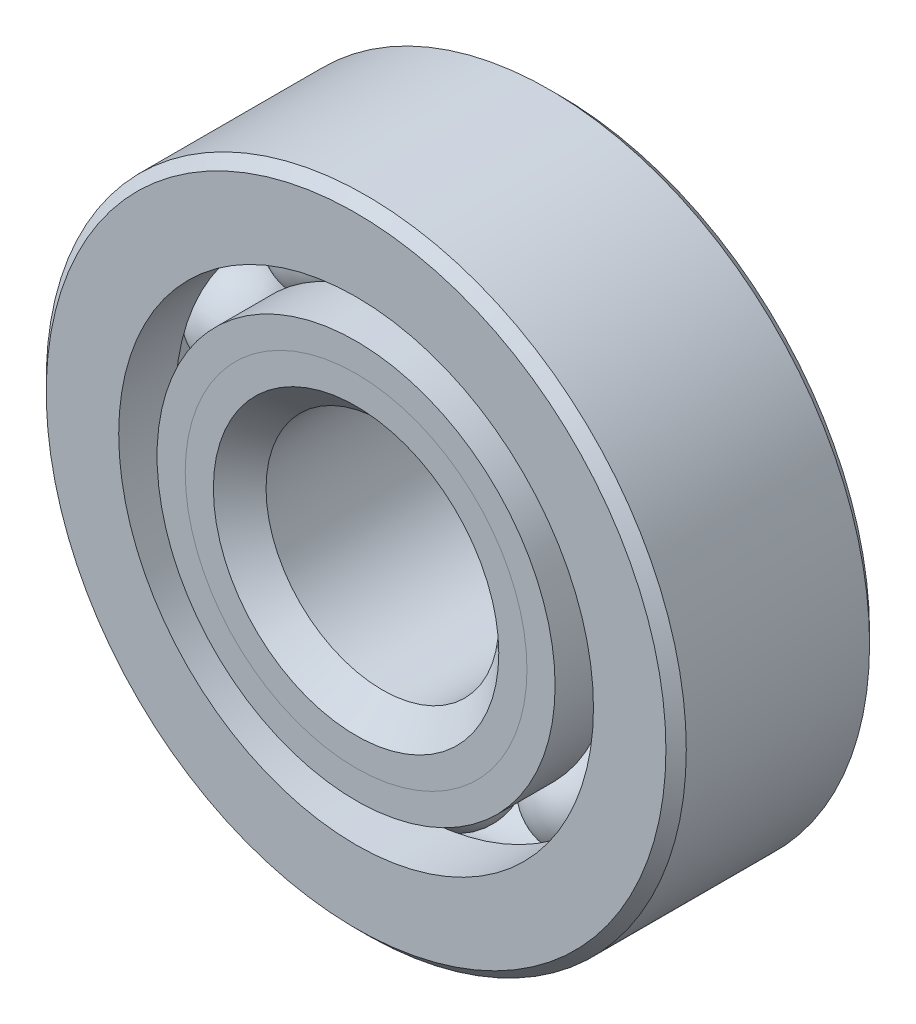
ISO-10303-21;
HEADER;
FILE_DESCRIPTION(('STEP AP214'),'2;1');
FILE_NAME('part.step','',(''),(''),'','','');
FILE_SCHEMA(('AUTOMOTIVE_DESIGN { 1 0 10303 214 1 1 1 1 }'));
ENDSEC;
DATA;
#1=APPLICATION_CONTEXT('core data for automotive mechanical design processes');
#2=APPLICATION_PROTOCOL_DEFINITION('international standard','automotive_design',2000,#1);
#3=PRODUCT_CONTEXT('',#1,'mechanical');
#4=PRODUCT('Part','Part','',(#3));
#5=PRODUCT_RELATED_PRODUCT_CATEGORY('part','',(#4));
#6=PRODUCT_DEFINITION_FORMATION('','',#4);
#7=PRODUCT_DEFINITION_CONTEXT('part definition',#1,'design');
#8=PRODUCT_DEFINITION('design','',#6,#7);
#9=PRODUCT_DEFINITION_SHAPE('','',#8);
#10=(LENGTH_UNIT() NAMED_UNIT(*) SI_UNIT(.MILLI.,.METRE.));
#11=(NAMED_UNIT(*) PLANE_ANGLE_UNIT() SI_UNIT($,.RADIAN.));
#12=(NAMED_UNIT(*) SI_UNIT($,.STERADIAN.) SOLID_ANGLE_UNIT());
#13=UNCERTAINTY_MEASURE_WITH_UNIT(LENGTH_MEASURE(1.E-05),#10,'distance_accuracy_value','');
#14=(GEOMETRIC_REPRESENTATION_CONTEXT(3) GLOBAL_UNCERTAINTY_ASSIGNED_CONTEXT((#13)) GLOBAL_UNIT_ASSIGNED_CONTEXT((#10,
#11,#12)) REPRESENTATION_CONTEXT('',''));
#15=CARTESIAN_POINT('',(0.,0.,0.));
#16=DIRECTION('',(0.,0.,1.));
#17=DIRECTION('',(1.,0.,0.));
#18=AXIS2_PLACEMENT_3D('',#15,#16,#17);
#19=CARTESIAN_POINT('',(-4.40838939219347,6.06762745781216,0.));
#20=DIRECTION('',(0.,0.,1.));
#21=DIRECTION('',(-0.587785252292462,0.809016994374955,0.));
#22=AXIS2_PLACEMENT_3D('',#19,#20,#21);
#23=SPHERICAL_SURFACE('',#22,1.68952158656808);
#24=CARTESIAN_POINT('',(-4.40838939219347,6.06762745781216,1.68952158656808));
#25=VERTEX_POINT('',#24);
#26=VERTEX_LOOP('',#25);
#27=FACE_BOUND('',#26,.T.);
#28=ADVANCED_FACE('F39',(#27),#23,.T.);
#29=CLOSED_SHELL('',(#28));
#30=MANIFOLD_SOLID_BREP('B2',#29);
#31=CARTESIAN_POINT('',(-7.13292387221363,2.31762745781219,0.));
#32=DIRECTION('',(0.,0.,1.));
#33=DIRECTION('',(-0.95105651629515,0.309016994374958,0.));
#34=AXIS2_PLACEMENT_3D('',#31,#32,#33);
#35=SPHERICAL_SURFACE('',#34,1.68952158656808);
#36=CARTESIAN_POINT('',(-7.13292387221363,2.31762745781219,1.68952158656808));
#37=VERTEX_POINT('',#36);
#38=VERTEX_LOOP('',#37);
#39=FACE_BOUND('',#38,.T.);
#40=ADVANCED_FACE('F70',(#39),#35,.T.);
#41=CLOSED_SHELL('',(#40));
#42=MANIFOLD_SOLID_BREP('B6',#41);
#43=CARTESIAN_POINT('',(-7.13292387221367,-2.31762745781204,0.));
#44=DIRECTION('',(0.,0.,1.));
#45=DIRECTION('',(-0.951056516295157,-0.309016994374938,0.));
#46=AXIS2_PLACEMENT_3D('',#43,#44,#45);
#47=SPHERICAL_SURFACE('',#46,1.68952158656808);
#48=CARTESIAN_POINT('',(-7.13292387221367,-2.31762745781204,1.68952158656808));
#49=VERTEX_POINT('',#48);
#50=VERTEX_LOOP('',#49);
#51=FACE_BOUND('',#50,.T.);
#52=ADVANCED_FACE('F101',(#51),#47,.T.);
#53=CLOSED_SHELL('',(#52));
#54=MANIFOLD_SOLID_BREP('B35',#53);
#55=CARTESIAN_POINT('',(-4.4083893921936,-6.06762745781207,0.));
#56=DIRECTION('',(0.,0.,1.));
#57=DIRECTION('',(-0.58778525229248,-0.809016994374942,0.));
#58=AXIS2_PLACEMENT_3D('',#55,#56,#57);
#59=SPHERICAL_SURFACE('',#58,1.68952158656808);
#60=CARTESIAN_POINT('',(-4.4083893921936,-6.06762745781207,1.68952158656808));
#61=VERTEX_POINT('',#60);
#62=VERTEX_LOOP('',#61);
#63=FACE_BOUND('',#62,.T.);
#64=ADVANCED_FACE('F132',(#63),#59,.T.);
#65=CLOSED_SHELL('',(#64));
#66=MANIFOLD_SOLID_BREP('B66',#65);
#67=CARTESIAN_POINT('',(0.,-7.5,0.));
#68=DIRECTION('',(0.,0.,1.));
#69=DIRECTION('',(0.,-1.,0.));
#70=AXIS2_PLACEMENT_3D('',#67,#68,#69);
#71=SPHERICAL_SURFACE('',#70,1.68952158656808);
#72=CARTESIAN_POINT('',(0.,-7.5,1.68952158656808));
#73=VERTEX_POINT('',#72);
#74=VERTEX_LOOP('',#73);
#75=FACE_BOUND('',#74,.T.);
#76=ADVANCED_FACE('F165',(#75),#71,.T.);
#77=CLOSED_SHELL('',(#76));
#78=MANIFOLD_SOLID_BREP('B97',#77);
#79=CARTESIAN_POINT('',(4.40838939219351,-6.06762745781213,0.));
#80=DIRECTION('',(0.,0.,1.));
#81=DIRECTION('',(0.587785252292469,-0.809016994374951,0.));
#82=AXIS2_PLACEMENT_3D('',#79,#80,#81);
#83=SPHERICAL_SURFACE('',#82,1.68952158656808);
#84=CARTESIAN_POINT('',(4.40838939219351,-6.06762745781213,1.68952158656808));
#85=VERTEX_POINT('',#84);
#86=VERTEX_LOOP('',#85);
#87=FACE_BOUND('',#86,.T.);
#88=ADVANCED_FACE('F196',(#87),#83,.T.);
#89=CLOSED_SHELL('',(#88));
#90=MANIFOLD_SOLID_BREP('B128',#89);
#91=CARTESIAN_POINT('',(7.13292387221364,-2.31762745781214,0.));
#92=DIRECTION('',(0.,0.,1.));
#93=DIRECTION('',(0.951056516295152,-0.309016994374952,0.));
#94=AXIS2_PLACEMENT_3D('',#91,#92,#93);
#95=SPHERICAL_SURFACE('',#94,1.68952158656808);
#96=CARTESIAN_POINT('',(7.13292387221364,-2.31762745781214,1.68952158656808));
#97=VERTEX_POINT('',#96);
#98=VERTEX_LOOP('',#97);
#99=FACE_BOUND('',#98,.T.);
#100=ADVANCED_FACE('F227',(#99),#95,.T.);
#101=CLOSED_SHELL('',(#100));
#102=MANIFOLD_SOLID_BREP('B161',#101);
#103=CARTESIAN_POINT('',(7.13292387221366,2.31762745781209,0.));
#104=DIRECTION('',(0.,0.,1.));
#105=DIRECTION('',(0.951056516295155,0.309016994374945,0.));
#106=AXIS2_PLACEMENT_3D('',#103,#104,#105);
#107=SPHERICAL_SURFACE('',#106,1.68952158656808);
#108=CARTESIAN_POINT('',(7.13292387221366,2.31762745781209,1.68952158656808));
#109=VERTEX_POINT('',#108);
#110=VERTEX_LOOP('',#109);
#111=FACE_BOUND('',#110,.T.);
#112=ADVANCED_FACE('F258',(#111),#107,.T.);
#113=CLOSED_SHELL('',(#112));
#114=MANIFOLD_SOLID_BREP('B192',#113);
#115=CARTESIAN_POINT('',(4.40838939219356,6.0676274578121,0.));
#116=DIRECTION('',(0.,0.,1.));
#117=DIRECTION('',(0.587785252292474,0.809016994374947,0.));
#118=AXIS2_PLACEMENT_3D('',#115,#116,#117);
#119=SPHERICAL_SURFACE('',#118,1.68952158656808);
#120=CARTESIAN_POINT('',(4.40838939219356,6.0676274578121,1.68952158656808));
#121=VERTEX_POINT('',#120);
#122=VERTEX_LOOP('',#121);
#123=FACE_BOUND('',#122,.T.);
#124=ADVANCED_FACE('F289',(#123),#119,.T.);
#125=CLOSED_SHELL('',(#124));
#126=MANIFOLD_SOLID_BREP('B223',#125);
#127=CARTESIAN_POINT('',(0.,7.5,0.));
#128=DIRECTION('',(0.,0.,1.));
#129=DIRECTION('',(0.,1.,0.));
#130=AXIS2_PLACEMENT_3D('',#127,#128,#129);
#131=SPHERICAL_SURFACE('',#130,1.68952158656808);
#132=CARTESIAN_POINT('',(0.,7.5,1.68952158656808));
#133=VERTEX_POINT('',#132);
#134=VERTEX_LOOP('',#133);
#135=FACE_BOUND('',#134,.T.);
#136=ADVANCED_FACE('F324',(#135),#131,.T.);
#137=CLOSED_SHELL('',(#136));
#138=MANIFOLD_SOLID_BREP('B254',#137);
#139=CARTESIAN_POINT('',(0.,5.87294927368765,3.5));
#140=DIRECTION('',(0.,0.,-1.));
#141=DIRECTION('',(-1.,0.,0.));
#142=AXIS2_PLACEMENT_3D('',#139,#140,#141);
#143=PLANE('',#142);
#144=CARTESIAN_POINT('',(0.,0.,3.5));
#145=DIRECTION('',(0.,0.,1.));
#146=DIRECTION('',(1.,0.,0.));
#147=AXIS2_PLACEMENT_3D('',#144,#145,#146);
#148=CIRCLE('',#147,4.90523920671596);
#149=CARTESIAN_POINT('',(4.90523920671596,0.,3.5));
#150=VERTEX_POINT('',#149);
#151=EDGE_CURVE('E378',#150,#150,#148,.T.);
#152=ORIENTED_EDGE('',*,*,#151,.F.);
#153=EDGE_LOOP('',(#152));
#154=FACE_BOUND('',#153,.T.);
#155=CARTESIAN_POINT('',(0.,0.,3.5));
#156=DIRECTION('',(0.,0.,1.));
#157=DIRECTION('',(1.,0.,0.));
#158=AXIS2_PLACEMENT_3D('',#155,#156,#157);
#159=CIRCLE('',#158,5.87294927368765);
#160=CARTESIAN_POINT('',(5.87294927368765,0.,3.5));
#161=VERTEX_POINT('',#160);
#162=EDGE_CURVE('E323',#161,#161,#159,.T.);
#163=ORIENTED_EDGE('',*,*,#162,.T.);
#164=EDGE_LOOP('',(#163));
#165=FACE_BOUND('',#164,.T.);
#166=ADVANCED_FACE('F344',(#154,#165),#143,.F.);
#167=CARTESIAN_POINT('',(0.,0.,2.53228993302831));
#168=DIRECTION('',(0.,0.,1.));
#169=DIRECTION('',(1.,0.,0.));
#170=AXIS2_PLACEMENT_3D('',#167,#168,#169);
#171=CONICAL_SURFACE('',#170,4.90523920671596,0.78539816339745);
#172=ORIENTED_EDGE('',*,*,#162,.F.);
#173=EDGE_LOOP('',(#172));
#174=FACE_BOUND('',#173,.T.);
#175=CARTESIAN_POINT('',(0.,0.,2.53228993302831));
#176=DIRECTION('',(0.,0.,1.));
#177=DIRECTION('',(1.,0.,0.));
#178=AXIS2_PLACEMENT_3D('',#175,#176,#177);
#179=CIRCLE('',#178,4.90523920671596);
#180=CARTESIAN_POINT('',(4.90523920671596,0.,2.53228993302831));
#181=VERTEX_POINT('',#180);
#182=EDGE_CURVE('E350',#181,#181,#179,.T.);
#183=ORIENTED_EDGE('',*,*,#182,.T.);
#184=EDGE_LOOP('',(#183));
#185=FACE_BOUND('',#184,.T.);
#186=ADVANCED_FACE('F385',(#174,#185),#171,.T.);
#187=CARTESIAN_POINT('',(0.,0.,3.5));
#188=DIRECTION('',(0.,0.,1.));
#189=DIRECTION('',(1.,0.,0.));
#190=AXIS2_PLACEMENT_3D('',#187,#188,#189);
#191=CYLINDRICAL_SURFACE('',#190,4.90523920671596);
#192=ORIENTED_EDGE('',*,*,#182,.F.);
#193=EDGE_LOOP('',(#192));
#194=FACE_BOUND('',#193,.T.);
#195=CARTESIAN_POINT('',(0.,0.,0.));
#196=DIRECTION('',(0.,0.,1.));
#197=DIRECTION('',(1.,0.,0.));
#198=AXIS2_PLACEMENT_3D('',#195,#196,#197);
#199=CIRCLE('',#198,4.90523920671596);
#200=CARTESIAN_POINT('',(4.90523920671596,0.,0.));
#201=VERTEX_POINT('',#200);
#202=EDGE_CURVE('E354',#201,#201,#199,.T.);
#203=ORIENTED_EDGE('',*,*,#202,.T.);
#204=EDGE_LOOP('',(#203));
#205=FACE_BOUND('',#204,.T.);
#206=ADVANCED_FACE('F389',(#194,#205),#191,.T.);
#207=CARTESIAN_POINT('',(0.,4.90523920671596,0.));
#208=DIRECTION('',(0.,0.,-1.));
#209=DIRECTION('',(-1.,0.,0.));
#210=AXIS2_PLACEMENT_3D('',#207,#208,#209);
#211=PLANE('',#210);
#212=ORIENTED_EDGE('',*,*,#202,.F.);
#213=EDGE_LOOP('',(#212));
#214=FACE_BOUND('',#213,.T.);
#215=CARTESIAN_POINT('',(0.,0.,0.));
#216=DIRECTION('',(0.,0.,1.));
#217=DIRECTION('',(1.,0.,0.));
#218=AXIS2_PLACEMENT_3D('',#215,#216,#217);
#219=CIRCLE('',#218,5.81047841343192);
#220=CARTESIAN_POINT('',(5.81047841343192,0.,0.));
#221=VERTEX_POINT('',#220);
#222=EDGE_CURVE('E358',#221,#221,#219,.T.);
#223=ORIENTED_EDGE('',*,*,#222,.T.);
#224=EDGE_LOOP('',(#223));
#225=FACE_BOUND('',#224,.T.);
#226=ADVANCED_FACE('F394',(#214,#225),#211,.F.);
#227=CARTESIAN_POINT('',(0.,0.,0.));
#228=DIRECTION('',(0.,0.,1.));
#229=DIRECTION('',(1.,0.,0.));
#230=AXIS2_PLACEMENT_3D('',#227,#228,#229);
#231=TOROIDAL_SURFACE('',#230,7.5,1.68952158656808);
#232=ORIENTED_EDGE('',*,*,#222,.F.);
#233=EDGE_LOOP('',(#232));
#234=FACE_BOUND('',#233,.T.);
#235=CARTESIAN_POINT('',(0.,0.,-1.55555555555556));
#236=DIRECTION('',(0.,0.,1.));
#237=DIRECTION('',(1.,0.,0.));
#238=AXIS2_PLACEMENT_3D('',#235,#236,#237);
#239=CIRCLE('',#238,6.84065934065934);
#240=CARTESIAN_POINT('',(6.84065934065934,0.,-1.55555555555556));
#241=VERTEX_POINT('',#240);
#242=EDGE_CURVE('E363',#241,#241,#239,.T.);
#243=ORIENTED_EDGE('',*,*,#242,.T.);
#244=EDGE_LOOP('',(#243));
#245=FACE_BOUND('',#244,.T.);
#246=ADVANCED_FACE('F400',(#234,#245),#231,.F.);
#247=CARTESIAN_POINT('',(0.,0.,3.5));
#248=DIRECTION('',(0.,0.,1.));
#249=DIRECTION('',(1.,0.,0.));
#250=AXIS2_PLACEMENT_3D('',#247,#248,#249);
#251=CYLINDRICAL_SURFACE('',#250,6.84065934065934);
#252=ORIENTED_EDGE('',*,*,#242,.F.);
#253=EDGE_LOOP('',(#252));
#254=FACE_BOUND('',#253,.T.);
#255=CARTESIAN_POINT('',(0.,0.,-3.5));
#256=DIRECTION('',(0.,0.,1.));
#257=DIRECTION('',(1.,0.,0.));
#258=AXIS2_PLACEMENT_3D('',#255,#256,#257);
#259=CIRCLE('',#258,6.84065934065934);
#260=CARTESIAN_POINT('',(6.84065934065934,0.,-3.5));
#261=VERTEX_POINT('',#260);
#262=EDGE_CURVE('E366',#261,#261,#259,.T.);
#263=ORIENTED_EDGE('',*,*,#262,.T.);
#264=EDGE_LOOP('',(#263));
#265=FACE_BOUND('',#264,.T.);
#266=ADVANCED_FACE('F404',(#254,#265),#251,.T.);
#267=CARTESIAN_POINT('',(0.,4.35,-3.5));
#268=DIRECTION('',(0.,0.,1.));
#269=DIRECTION('',(1.,0.,0.));
#270=AXIS2_PLACEMENT_3D('',#267,#268,#269);
#271=PLANE('',#270);
#272=ORIENTED_EDGE('',*,*,#262,.F.);
#273=EDGE_LOOP('',(#272));
#274=FACE_BOUND('',#273,.T.);
#275=CARTESIAN_POINT('',(0.,0.,-3.5));
#276=DIRECTION('',(0.,0.,1.));
#277=DIRECTION('',(1.,0.,0.));
#278=AXIS2_PLACEMENT_3D('',#275,#276,#277);
#279=CIRCLE('',#278,4.35);
#280=CARTESIAN_POINT('',(4.35,0.,-3.5));
#281=VERTEX_POINT('',#280);
#282=EDGE_CURVE('E369',#281,#281,#279,.T.);
#283=ORIENTED_EDGE('',*,*,#282,.T.);
#284=EDGE_LOOP('',(#283));
#285=FACE_BOUND('',#284,.T.);
#286=ADVANCED_FACE('F408',(#274,#285),#271,.F.);
#287=CARTESIAN_POINT('',(0.,0.,-3.15));
#288=DIRECTION('',(0.,0.,-1.));
#289=DIRECTION('',(-1.,0.,0.));
#290=AXIS2_PLACEMENT_3D('',#287,#288,#289);
#291=CONICAL_SURFACE('',#290,4.,0.785398163397448);
#292=ORIENTED_EDGE('',*,*,#282,.F.);
#293=EDGE_LOOP('',(#292));
#294=FACE_BOUND('',#293,.T.);
#295=CARTESIAN_POINT('',(0.,0.,-3.15));
#296=DIRECTION('',(0.,0.,1.));
#297=DIRECTION('',(1.,0.,0.));
#298=AXIS2_PLACEMENT_3D('',#295,#296,#297);
#299=CIRCLE('',#298,4.);
#300=CARTESIAN_POINT('',(4.,0.,-3.15));
#301=VERTEX_POINT('',#300);
#302=EDGE_CURVE('E372',#301,#301,#299,.T.);
#303=ORIENTED_EDGE('',*,*,#302,.T.);
#304=EDGE_LOOP('',(#303));
#305=FACE_BOUND('',#304,.T.);
#306=ADVANCED_FACE('F412',(#294,#305),#291,.F.);
#307=CARTESIAN_POINT('',(0.,0.,3.5));
#308=DIRECTION('',(0.,0.,1.));
#309=DIRECTION('',(1.,0.,0.));
#310=AXIS2_PLACEMENT_3D('',#307,#308,#309);
#311=CYLINDRICAL_SURFACE('',#310,4.);
#312=ORIENTED_EDGE('',*,*,#302,.F.);
#313=EDGE_LOOP('',(#312));
#314=FACE_BOUND('',#313,.T.);
#315=CARTESIAN_POINT('',(0.,0.,2.59476079328405));
#316=DIRECTION('',(0.,0.,1.));
#317=DIRECTION('',(1.,0.,0.));
#318=AXIS2_PLACEMENT_3D('',#315,#316,#317);
#319=CIRCLE('',#318,4.);
#320=CARTESIAN_POINT('',(4.,0.,2.59476079328405));
#321=VERTEX_POINT('',#320);
#322=EDGE_CURVE('E375',#321,#321,#319,.T.);
#323=ORIENTED_EDGE('',*,*,#322,.T.);
#324=EDGE_LOOP('',(#323));
#325=FACE_BOUND('',#324,.T.);
#326=ADVANCED_FACE('F416',(#314,#325),#311,.F.);
#327=CARTESIAN_POINT('',(0.,0.,3.5));
#328=DIRECTION('',(0.,0.,1.));
#329=DIRECTION('',(1.,0.,0.));
#330=AXIS2_PLACEMENT_3D('',#327,#328,#329);
#331=CONICAL_SURFACE('',#330,4.90523920671596,0.78539816339745);
#332=ORIENTED_EDGE('',*,*,#322,.F.);
#333=EDGE_LOOP('',(#332));
#334=FACE_BOUND('',#333,.T.);
#335=ORIENTED_EDGE('',*,*,#151,.T.);
#336=EDGE_LOOP('',(#335));
#337=FACE_BOUND('',#336,.T.);
#338=ADVANCED_FACE('F382',(#334,#337),#331,.F.);
#339=CLOSED_SHELL('',(#166,#186,#206,#226,#246,#266,#286,#306,#326,#338));
#340=MANIFOLD_SOLID_BREP('B285',#339);
#341=CARTESIAN_POINT('',(0.,6.84065934065934,3.5));
#342=DIRECTION('',(0.,0.,-1.));
#343=DIRECTION('',(-1.,0.,0.));
#344=AXIS2_PLACEMENT_3D('',#341,#342,#343);
#345=PLANE('',#344);
#346=CARTESIAN_POINT('',(0.,0.,3.5));
#347=DIRECTION('',(0.,0.,1.));
#348=DIRECTION('',(1.,0.,0.));
#349=AXIS2_PLACEMENT_3D('',#346,#347,#348);
#350=CIRCLE('',#349,5.87294927368765);
#351=CARTESIAN_POINT('',(5.87294927368765,0.,3.5));
#352=VERTEX_POINT('',#351);
#353=EDGE_CURVE('E343',#352,#352,#350,.T.);
#354=ORIENTED_EDGE('',*,*,#353,.F.);
#355=EDGE_LOOP('',(#354));
#356=FACE_BOUND('',#355,.T.);
#357=CARTESIAN_POINT('',(0.,0.,3.5));
#358=DIRECTION('',(0.,0.,1.));
#359=DIRECTION('',(1.,0.,0.));
#360=AXIS2_PLACEMENT_3D('',#357,#358,#359);
#361=CIRCLE('',#360,6.84065934065934);
#362=CARTESIAN_POINT('',(6.84065934065934,0.,3.5));
#363=VERTEX_POINT('',#362);
#364=EDGE_CURVE('E524',#363,#363,#361,.T.);
#365=ORIENTED_EDGE('',*,*,#364,.T.);
#366=EDGE_LOOP('',(#365));
#367=FACE_BOUND('',#366,.T.);
#368=ADVANCED_FACE('F502',(#356,#367),#345,.F.);
#369=CARTESIAN_POINT('',(0.,0.,3.5));
#370=DIRECTION('',(0.,0.,1.));
#371=DIRECTION('',(1.,0.,0.));
#372=AXIS2_PLACEMENT_3D('',#369,#370,#371);
#373=CONICAL_SURFACE('',#372,5.87294927368765,0.78539816339745);
#374=CARTESIAN_POINT('',(0.,0.,2.53228993302831));
#375=DIRECTION('',(0.,0.,1.));
#376=DIRECTION('',(1.,0.,0.));
#377=AXIS2_PLACEMENT_3D('',#374,#375,#376);
#378=CIRCLE('',#377,4.90523920671596);
#379=CARTESIAN_POINT('',(4.90523920671596,0.,2.53228993302831));
#380=VERTEX_POINT('',#379);
#381=EDGE_CURVE('E508',#380,#380,#378,.T.);
#382=ORIENTED_EDGE('',*,*,#381,.F.);
#383=EDGE_LOOP('',(#382));
#384=FACE_BOUND('',#383,.T.);
#385=ORIENTED_EDGE('',*,*,#353,.T.);
#386=EDGE_LOOP('',(#385));
#387=FACE_BOUND('',#386,.T.);
#388=ADVANCED_FACE('F549',(#384,#387),#373,.F.);
#389=CARTESIAN_POINT('',(0.,0.,3.5));
#390=DIRECTION('',(0.,0.,1.));
#391=DIRECTION('',(1.,0.,0.));
#392=AXIS2_PLACEMENT_3D('',#389,#390,#391);
#393=CYLINDRICAL_SURFACE('',#392,4.90523920671596);
#394=CARTESIAN_POINT('',(0.,0.,0.));
#395=DIRECTION('',(0.,0.,1.));
#396=DIRECTION('',(1.,0.,0.));
#397=AXIS2_PLACEMENT_3D('',#394,#395,#396);
#398=CIRCLE('',#397,4.90523920671596);
#399=CARTESIAN_POINT('',(4.90523920671596,0.,0.));
#400=VERTEX_POINT('',#399);
#401=EDGE_CURVE('E512',#400,#400,#398,.T.);
#402=ORIENTED_EDGE('',*,*,#401,.F.);
#403=EDGE_LOOP('',(#402));
#404=FACE_BOUND('',#403,.T.);
#405=ORIENTED_EDGE('',*,*,#381,.T.);
#406=EDGE_LOOP('',(#405));
#407=FACE_BOUND('',#406,.T.);
#408=ADVANCED_FACE('F544',(#404,#407),#393,.F.);
#409=CARTESIAN_POINT('',(0.,4.90523920671596,0.));
#410=DIRECTION('',(0.,0.,1.));
#411=DIRECTION('',(1.,0.,0.));
#412=AXIS2_PLACEMENT_3D('',#409,#410,#411);
#413=PLANE('',#412);
#414=CARTESIAN_POINT('',(0.,0.,0.));
#415=DIRECTION('',(0.,0.,1.));
#416=DIRECTION('',(1.,0.,0.));
#417=AXIS2_PLACEMENT_3D('',#414,#415,#416);
#418=CIRCLE('',#417,5.81047841343192);
#419=CARTESIAN_POINT('',(5.81047841343192,0.,0.));
#420=VERTEX_POINT('',#419);
#421=EDGE_CURVE('E516',#420,#420,#418,.T.);
#422=ORIENTED_EDGE('',*,*,#421,.F.);
#423=EDGE_LOOP('',(#422));
#424=FACE_BOUND('',#423,.T.);
#425=ORIENTED_EDGE('',*,*,#401,.T.);
#426=EDGE_LOOP('',(#425));
#427=FACE_BOUND('',#426,.T.);
#428=ADVANCED_FACE('F538',(#424,#427),#413,.F.);
#429=CARTESIAN_POINT('',(0.,0.,0.));
#430=DIRECTION('',(0.,0.,1.));
#431=DIRECTION('',(1.,0.,0.));
#432=AXIS2_PLACEMENT_3D('',#429,#430,#431);
#433=TOROIDAL_SURFACE('',#432,7.5,1.68952158656808);
#434=CARTESIAN_POINT('',(0.,0.,1.55555555555555));
#435=DIRECTION('',(0.,0.,1.));
#436=DIRECTION('',(1.,0.,0.));
#437=AXIS2_PLACEMENT_3D('',#434,#435,#436);
#438=CIRCLE('',#437,6.84065934065934);
#439=CARTESIAN_POINT('',(6.84065934065934,0.,1.55555555555555));
#440=VERTEX_POINT('',#439);
#441=EDGE_CURVE('E521',#440,#440,#438,.T.);
#442=ORIENTED_EDGE('',*,*,#441,.F.);
#443=EDGE_LOOP('',(#442));
#444=FACE_BOUND('',#443,.T.);
#445=ORIENTED_EDGE('',*,*,#421,.T.);
#446=EDGE_LOOP('',(#445));
#447=FACE_BOUND('',#446,.T.);
#448=ADVANCED_FACE('F532',(#444,#447),#433,.F.);
#449=CARTESIAN_POINT('',(0.,0.,3.5));
#450=DIRECTION('',(0.,0.,1.));
#451=DIRECTION('',(1.,0.,0.));
#452=AXIS2_PLACEMENT_3D('',#449,#450,#451);
#453=CYLINDRICAL_SURFACE('',#452,6.84065934065934);
#454=ORIENTED_EDGE('',*,*,#364,.F.);
#455=EDGE_LOOP('',(#454));
#456=FACE_BOUND('',#455,.T.);
#457=ORIENTED_EDGE('',*,*,#441,.T.);
#458=EDGE_LOOP('',(#457));
#459=FACE_BOUND('',#458,.T.);
#460=ADVANCED_FACE('F529',(#456,#459),#453,.T.);
#461=CLOSED_SHELL('',(#368,#388,#408,#428,#448,#460));
#462=MANIFOLD_SOLID_BREP('B318',#461);
#463=CARTESIAN_POINT('',(0.,0.,3.15));
#464=DIRECTION('',(0.,0.,-1.));
#465=DIRECTION('',(-1.,0.,0.));
#466=AXIS2_PLACEMENT_3D('',#463,#464,#465);
#467=CONICAL_SURFACE('',#466,11.,0.785398163397448);
#468=CARTESIAN_POINT('',(0.,0.,3.5));
#469=DIRECTION('',(0.,0.,1.));
#470=DIRECTION('',(1.,0.,0.));
#471=AXIS2_PLACEMENT_3D('',#468,#469,#470);
#472=CIRCLE('',#471,10.65);
#473=CARTESIAN_POINT('',(10.65,0.,3.5));
#474=VERTEX_POINT('',#473);
#475=EDGE_CURVE('E621',#474,#474,#472,.T.);
#476=ORIENTED_EDGE('',*,*,#475,.F.);
#477=EDGE_LOOP('',(#476));
#478=FACE_BOUND('',#477,.T.);
#479=CARTESIAN_POINT('',(0.,0.,3.15));
#480=DIRECTION('',(0.,0.,1.));
#481=DIRECTION('',(1.,0.,0.));
#482=AXIS2_PLACEMENT_3D('',#479,#480,#481);
#483=CIRCLE('',#482,11.);
#484=CARTESIAN_POINT('',(11.,0.,3.15));
#485=VERTEX_POINT('',#484);
#486=EDGE_CURVE('E501',#485,#485,#483,.T.);
#487=ORIENTED_EDGE('',*,*,#486,.T.);
#488=EDGE_LOOP('',(#487));
#489=FACE_BOUND('',#488,.T.);
#490=ADVANCED_FACE('F593',(#478,#489),#467,.T.);
#491=CARTESIAN_POINT('',(0.,0.,3.5));
#492=DIRECTION('',(0.,0.,1.));
#493=DIRECTION('',(1.,0.,0.));
#494=AXIS2_PLACEMENT_3D('',#491,#492,#493);
#495=CYLINDRICAL_SURFACE('',#494,11.);
#496=ORIENTED_EDGE('',*,*,#486,.F.);
#497=EDGE_LOOP('',(#496));
#498=FACE_BOUND('',#497,.T.);
#499=CARTESIAN_POINT('',(0.,0.,-3.15));
#500=DIRECTION('',(0.,0.,1.));
#501=DIRECTION('',(1.,0.,0.));
#502=AXIS2_PLACEMENT_3D('',#499,#500,#501);
#503=CIRCLE('',#502,11.);
#504=CARTESIAN_POINT('',(11.,0.,-3.15));
#505=VERTEX_POINT('',#504);
#506=EDGE_CURVE('E599',#505,#505,#503,.T.);
#507=ORIENTED_EDGE('',*,*,#506,.T.);
#508=EDGE_LOOP('',(#507));
#509=FACE_BOUND('',#508,.T.);
#510=ADVANCED_FACE('F628',(#498,#509),#495,.T.);
#511=CARTESIAN_POINT('',(0.,0.,-3.5));
#512=DIRECTION('',(0.,0.,1.));
#513=DIRECTION('',(1.,0.,0.));
#514=AXIS2_PLACEMENT_3D('',#511,#512,#513);
#515=CONICAL_SURFACE('',#514,10.65,0.785398163397447);
#516=ORIENTED_EDGE('',*,*,#506,.F.);
#517=EDGE_LOOP('',(#516));
#518=FACE_BOUND('',#517,.T.);
#519=CARTESIAN_POINT('',(0.,0.,-3.5));
#520=DIRECTION('',(0.,0.,1.));
#521=DIRECTION('',(1.,0.,0.));
#522=AXIS2_PLACEMENT_3D('',#519,#520,#521);
#523=CIRCLE('',#522,10.65);
#524=CARTESIAN_POINT('',(10.65,0.,-3.5));
#525=VERTEX_POINT('',#524);
#526=EDGE_CURVE('E603',#525,#525,#523,.T.);
#527=ORIENTED_EDGE('',*,*,#526,.T.);
#528=EDGE_LOOP('',(#527));
#529=FACE_BOUND('',#528,.T.);
#530=ADVANCED_FACE('F632',(#518,#529),#515,.T.);
#531=CARTESIAN_POINT('',(0.,10.65,-3.5));
#532=DIRECTION('',(0.,0.,1.));
#533=DIRECTION('',(1.,0.,0.));
#534=AXIS2_PLACEMENT_3D('',#531,#532,#533);
#535=PLANE('',#534);
#536=ORIENTED_EDGE('',*,*,#526,.F.);
#537=EDGE_LOOP('',(#536));
#538=FACE_BOUND('',#537,.T.);
#539=CARTESIAN_POINT('',(0.,0.,-3.5));
#540=DIRECTION('',(0.,0.,1.));
#541=DIRECTION('',(1.,0.,0.));
#542=AXIS2_PLACEMENT_3D('',#539,#540,#541);
#543=CIRCLE('',#542,8.15934065934066);
#544=CARTESIAN_POINT('',(8.15934065934066,0.,-3.5));
#545=VERTEX_POINT('',#544);
#546=EDGE_CURVE('E607',#545,#545,#543,.T.);
#547=ORIENTED_EDGE('',*,*,#546,.T.);
#548=EDGE_LOOP('',(#547));
#549=FACE_BOUND('',#548,.T.);
#550=ADVANCED_FACE('F637',(#538,#549),#535,.F.);
#551=CARTESIAN_POINT('',(0.,0.,3.5));
#552=DIRECTION('',(0.,0.,1.));
#553=DIRECTION('',(1.,0.,0.));
#554=AXIS2_PLACEMENT_3D('',#551,#552,#553);
#555=CYLINDRICAL_SURFACE('',#554,8.15934065934066);
#556=ORIENTED_EDGE('',*,*,#546,.F.);
#557=EDGE_LOOP('',(#556));
#558=FACE_BOUND('',#557,.T.);
#559=CARTESIAN_POINT('',(0.,0.,-1.55555555555556));
#560=DIRECTION('',(0.,0.,1.));
#561=DIRECTION('',(1.,0.,0.));
#562=AXIS2_PLACEMENT_3D('',#559,#560,#561);
#563=CIRCLE('',#562,8.15934065934066);
#564=CARTESIAN_POINT('',(8.15934065934066,0.,-1.55555555555556));
#565=VERTEX_POINT('',#564);
#566=EDGE_CURVE('E612',#565,#565,#563,.T.);
#567=ORIENTED_EDGE('',*,*,#566,.T.);
#568=EDGE_LOOP('',(#567));
#569=FACE_BOUND('',#568,.T.);
#570=ADVANCED_FACE('F643',(#558,#569),#555,.F.);
#571=CARTESIAN_POINT('',(0.,0.,0.));
#572=DIRECTION('',(0.,0.,1.));
#573=DIRECTION('',(1.,0.,0.));
#574=AXIS2_PLACEMENT_3D('',#571,#572,#573);
#575=TOROIDAL_SURFACE('',#574,7.5,1.68952158656808);
#576=ORIENTED_EDGE('',*,*,#566,.F.);
#577=EDGE_LOOP('',(#576));
#578=FACE_BOUND('',#577,.T.);
#579=CARTESIAN_POINT('',(0.,0.,1.55555555555555));
#580=DIRECTION('',(0.,0.,1.));
#581=DIRECTION('',(1.,0.,0.));
#582=AXIS2_PLACEMENT_3D('',#579,#580,#581);
#583=CIRCLE('',#582,8.15934065934066);
#584=CARTESIAN_POINT('',(8.15934065934066,0.,1.55555555555555));
#585=VERTEX_POINT('',#584);
#586=EDGE_CURVE('E615',#585,#585,#583,.T.);
#587=ORIENTED_EDGE('',*,*,#586,.T.);
#588=EDGE_LOOP('',(#587));
#589=FACE_BOUND('',#588,.T.);
#590=ADVANCED_FACE('F647',(#578,#589),#575,.F.);
#591=CARTESIAN_POINT('',(0.,0.,3.5));
#592=DIRECTION('',(0.,0.,1.));
#593=DIRECTION('',(1.,0.,0.));
#594=AXIS2_PLACEMENT_3D('',#591,#592,#593);
#595=CYLINDRICAL_SURFACE('',#594,8.15934065934066);
#596=ORIENTED_EDGE('',*,*,#586,.F.);
#597=EDGE_LOOP('',(#596));
#598=FACE_BOUND('',#597,.T.);
#599=CARTESIAN_POINT('',(0.,0.,3.5));
#600=DIRECTION('',(0.,0.,1.));
#601=DIRECTION('',(1.,0.,0.));
#602=AXIS2_PLACEMENT_3D('',#599,#600,#601);
#603=CIRCLE('',#602,8.15934065934066);
#604=CARTESIAN_POINT('',(8.15934065934066,0.,3.5));
#605=VERTEX_POINT('',#604);
#606=EDGE_CURVE('E618',#605,#605,#603,.T.);
#607=ORIENTED_EDGE('',*,*,#606,.T.);
#608=EDGE_LOOP('',(#607));
#609=FACE_BOUND('',#608,.T.);
#610=ADVANCED_FACE('F651',(#598,#609),#595,.F.);
#611=CARTESIAN_POINT('',(0.,10.65,3.5));
#612=DIRECTION('',(0.,0.,-1.));
#613=DIRECTION('',(-1.,0.,0.));
#614=AXIS2_PLACEMENT_3D('',#611,#612,#613);
#615=PLANE('',#614);
#616=ORIENTED_EDGE('',*,*,#606,.F.);
#617=EDGE_LOOP('',(#616));
#618=FACE_BOUND('',#617,.T.);
#619=ORIENTED_EDGE('',*,*,#475,.T.);
#620=EDGE_LOOP('',(#619));
#621=FACE_BOUND('',#620,.T.);
#622=ADVANCED_FACE('F625',(#618,#621),#615,.F.);
#623=CLOSED_SHELL('',(#490,#510,#530,#550,#570,#590,#610,#622));
#624=MANIFOLD_SOLID_BREP('B338',#623);
#625=ADVANCED_BREP_SHAPE_REPRESENTATION('',(#18,#30,#42,#54,#66,#78,#90,#102,#114,#126,#138,
#340,#462,#624),#14);
#626=SHAPE_DEFINITION_REPRESENTATION(#9,#625);
ENDSEC;
END-ISO-10303-21;
